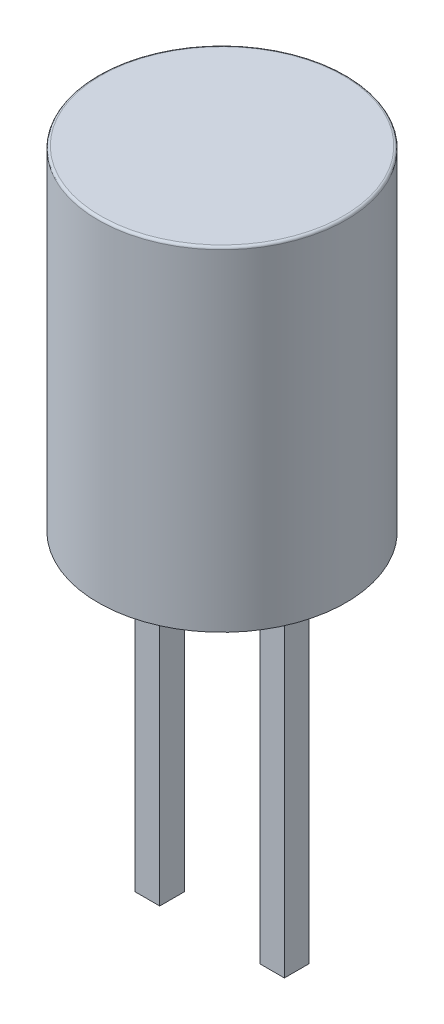
ISO-10303-21;
HEADER;
FILE_DESCRIPTION(('STEP AP214'),'2;1');
FILE_NAME('part.step','',(''),(''),'','','');
FILE_SCHEMA(('AUTOMOTIVE_DESIGN { 1 0 10303 214 1 1 1 1 }'));
ENDSEC;
DATA;
#1=APPLICATION_CONTEXT('core data for automotive mechanical design processes');
#2=APPLICATION_PROTOCOL_DEFINITION('international standard','automotive_design',2000,#1);
#3=PRODUCT_CONTEXT('',#1,'mechanical');
#4=PRODUCT('Part','Part','',(#3));
#5=PRODUCT_RELATED_PRODUCT_CATEGORY('part','',(#4));
#6=PRODUCT_DEFINITION_FORMATION('','',#4);
#7=PRODUCT_DEFINITION_CONTEXT('part definition',#1,'design');
#8=PRODUCT_DEFINITION('design','',#6,#7);
#9=PRODUCT_DEFINITION_SHAPE('','',#8);
#10=(LENGTH_UNIT() NAMED_UNIT(*) SI_UNIT(.MILLI.,.METRE.));
#11=(NAMED_UNIT(*) PLANE_ANGLE_UNIT() SI_UNIT($,.RADIAN.));
#12=(NAMED_UNIT(*) SI_UNIT($,.STERADIAN.) SOLID_ANGLE_UNIT());
#13=UNCERTAINTY_MEASURE_WITH_UNIT(LENGTH_MEASURE(1.E-05),#10,'distance_accuracy_value','');
#14=(GEOMETRIC_REPRESENTATION_CONTEXT(3) GLOBAL_UNCERTAINTY_ASSIGNED_CONTEXT((#13)) GLOBAL_UNIT_ASSIGNED_CONTEXT((#10,
#11,#12)) REPRESENTATION_CONTEXT('',''));
#15=CARTESIAN_POINT('',(0.,0.,0.));
#16=DIRECTION('',(0.,0.,1.));
#17=DIRECTION('',(1.,0.,0.));
#18=AXIS2_PLACEMENT_3D('',#15,#16,#17);
#19=CARTESIAN_POINT('',(0.,0.,0.));
#20=DIRECTION('',(0.,1.,0.));
#21=DIRECTION('',(0.,0.,-1.));
#22=AXIS2_PLACEMENT_3D('',#19,#20,#21);
#23=PLANE('',#22);
#24=DIRECTION('',(-1.,0.,0.));
#25=VECTOR('',#24,1.);
#26=CARTESIAN_POINT('',(-0.76,0.,-0.25));
#27=LINE('',#26,#25);
#28=CARTESIAN_POINT('',(-1.02,0.,-0.25));
#29=VERTEX_POINT('',#28);
#30=CARTESIAN_POINT('',(-1.52,0.,-0.25));
#31=VERTEX_POINT('',#30);
#32=EDGE_CURVE('E159',#29,#31,#27,.T.);
#33=ORIENTED_EDGE('',*,*,#32,.T.);
#34=DIRECTION('',(0.,0.,1.));
#35=VECTOR('',#34,1.);
#36=CARTESIAN_POINT('',(-1.52,0.,0.125));
#37=LINE('',#36,#35);
#38=CARTESIAN_POINT('',(-1.52,0.,0.25));
#39=VERTEX_POINT('',#38);
#40=EDGE_CURVE('E142',#31,#39,#37,.T.);
#41=ORIENTED_EDGE('',*,*,#40,.T.);
#42=DIRECTION('',(1.,0.,0.));
#43=VECTOR('',#42,1.);
#44=CARTESIAN_POINT('',(-0.51,0.,0.25));
#45=LINE('',#44,#43);
#46=CARTESIAN_POINT('',(-1.02,0.,0.25));
#47=VERTEX_POINT('',#46);
#48=EDGE_CURVE('E118',#39,#47,#45,.T.);
#49=ORIENTED_EDGE('',*,*,#48,.T.);
#50=DIRECTION('',(0.,0.,-1.));
#51=VECTOR('',#50,1.);
#52=CARTESIAN_POINT('',(-1.02,0.,-0.125));
#53=LINE('',#52,#51);
#54=EDGE_CURVE('E27',#47,#29,#53,.T.);
#55=ORIENTED_EDGE('',*,*,#54,.T.);
#56=EDGE_LOOP('',(#33,#41,#49,#55));
#57=FACE_BOUND('',#56,.T.);
#58=DIRECTION('',(-1.,0.,0.));
#59=VECTOR('',#58,1.);
#60=CARTESIAN_POINT('',(0.51,0.,-0.25));
#61=LINE('',#60,#59);
#62=CARTESIAN_POINT('',(1.52,0.,-0.25));
#63=VERTEX_POINT('',#62);
#64=CARTESIAN_POINT('',(1.02,0.,-0.25));
#65=VERTEX_POINT('',#64);
#66=EDGE_CURVE('E178',#63,#65,#61,.T.);
#67=ORIENTED_EDGE('',*,*,#66,.T.);
#68=DIRECTION('',(0.,0.,1.));
#69=VECTOR('',#68,1.);
#70=CARTESIAN_POINT('',(1.02,0.,0.125));
#71=LINE('',#70,#69);
#72=CARTESIAN_POINT('',(1.02,0.,0.25));
#73=VERTEX_POINT('',#72);
#74=EDGE_CURVE('E207',#65,#73,#71,.T.);
#75=ORIENTED_EDGE('',*,*,#74,.T.);
#76=DIRECTION('',(1.,0.,0.));
#77=VECTOR('',#76,1.);
#78=CARTESIAN_POINT('',(0.76,0.,0.25));
#79=LINE('',#78,#77);
#80=CARTESIAN_POINT('',(1.52,0.,0.25));
#81=VERTEX_POINT('',#80);
#82=EDGE_CURVE('E155',#73,#81,#79,.T.);
#83=ORIENTED_EDGE('',*,*,#82,.T.);
#84=DIRECTION('',(0.,0.,-1.));
#85=VECTOR('',#84,1.);
#86=CARTESIAN_POINT('',(1.52,0.,-0.125));
#87=LINE('',#86,#85);
#88=EDGE_CURVE('E66',#81,#63,#87,.T.);
#89=ORIENTED_EDGE('',*,*,#88,.T.);
#90=EDGE_LOOP('',(#67,#75,#83,#89));
#91=FACE_BOUND('',#90,.T.);
#92=CARTESIAN_POINT('',(0.,0.,0.));
#93=DIRECTION('',(0.,1.,0.));
#94=DIRECTION('',(1.,0.,0.));
#95=AXIS2_PLACEMENT_3D('',#92,#93,#94);
#96=CIRCLE('',#95,2.525);
#97=CARTESIAN_POINT('',(-2.525,0.,0.));
#98=VERTEX_POINT('',#97);
#99=EDGE_CURVE('E78',#98,#98,#96,.T.);
#100=ORIENTED_EDGE('',*,*,#99,.F.);
#101=EDGE_LOOP('',(#100));
#102=FACE_BOUND('',#101,.T.);
#103=ADVANCED_FACE('F16',(#57,#91,#102),#23,.F.);
#104=CARTESIAN_POINT('',(-1.27,-7.,0.));
#105=DIRECTION('',(0.,-1.,0.));
#106=DIRECTION('',(-1.,0.,0.));
#107=AXIS2_PLACEMENT_3D('',#104,#105,#106);
#108=PLANE('',#107);
#109=DIRECTION('',(0.,0.,1.));
#110=VECTOR('',#109,1.);
#111=CARTESIAN_POINT('',(-1.02,-7.,-0.25));
#112=LINE('',#111,#110);
#113=CARTESIAN_POINT('',(-1.02,-7.,-0.25));
#114=VERTEX_POINT('',#113);
#115=CARTESIAN_POINT('',(-1.02,-7.,0.25));
#116=VERTEX_POINT('',#115);
#117=EDGE_CURVE('E10',#114,#116,#112,.T.);
#118=ORIENTED_EDGE('',*,*,#117,.T.);
#119=DIRECTION('',(-1.,0.,0.));
#120=VECTOR('',#119,1.);
#121=CARTESIAN_POINT('',(-1.02,-7.,0.25));
#122=LINE('',#121,#120);
#123=CARTESIAN_POINT('',(-1.52,-7.,0.25));
#124=VERTEX_POINT('',#123);
#125=EDGE_CURVE('E123',#116,#124,#122,.T.);
#126=ORIENTED_EDGE('',*,*,#125,.T.);
#127=DIRECTION('',(0.,0.,-1.));
#128=VECTOR('',#127,1.);
#129=CARTESIAN_POINT('',(-1.52,-7.,0.25));
#130=LINE('',#129,#128);
#131=CARTESIAN_POINT('',(-1.52,-7.,-0.25));
#132=VERTEX_POINT('',#131);
#133=EDGE_CURVE('E126',#124,#132,#130,.T.);
#134=ORIENTED_EDGE('',*,*,#133,.T.);
#135=DIRECTION('',(1.,0.,0.));
#136=VECTOR('',#135,1.);
#137=CARTESIAN_POINT('',(-1.52,-7.,-0.25));
#138=LINE('',#137,#136);
#139=EDGE_CURVE('E191',#132,#114,#138,.T.);
#140=ORIENTED_EDGE('',*,*,#139,.T.);
#141=EDGE_LOOP('',(#118,#126,#134,#140));
#142=FACE_BOUND('',#141,.T.);
#143=ADVANCED_FACE('F124',(#142),#108,.T.);
#144=CARTESIAN_POINT('',(-1.02,0.,-0.25));
#145=DIRECTION('',(1.,0.,0.));
#146=DIRECTION('',(0.,1.,0.));
#147=AXIS2_PLACEMENT_3D('',#144,#145,#146);
#148=PLANE('',#147);
#149=ORIENTED_EDGE('',*,*,#54,.F.);
#150=DIRECTION('',(0.,-1.,0.));
#151=VECTOR('',#150,1.);
#152=CARTESIAN_POINT('',(-1.02,0.,0.25));
#153=LINE('',#152,#151);
#154=EDGE_CURVE('E129',#47,#116,#153,.T.);
#155=ORIENTED_EDGE('',*,*,#154,.T.);
#156=ORIENTED_EDGE('',*,*,#117,.F.);
#157=DIRECTION('',(0.,-1.,0.));
#158=VECTOR('',#157,1.);
#159=CARTESIAN_POINT('',(-1.02,0.,-0.25));
#160=LINE('',#159,#158);
#161=EDGE_CURVE('E163',#29,#114,#160,.T.);
#162=ORIENTED_EDGE('',*,*,#161,.F.);
#163=EDGE_LOOP('',(#149,#155,#156,#162));
#164=FACE_BOUND('',#163,.T.);
#165=ADVANCED_FACE('F257',(#164),#148,.T.);
#166=CARTESIAN_POINT('',(-1.02,0.,0.25));
#167=DIRECTION('',(0.,0.,1.));
#168=DIRECTION('',(0.,-1.,0.));
#169=AXIS2_PLACEMENT_3D('',#166,#167,#168);
#170=PLANE('',#169);
#171=ORIENTED_EDGE('',*,*,#48,.F.);
#172=DIRECTION('',(0.,-1.,0.));
#173=VECTOR('',#172,1.);
#174=CARTESIAN_POINT('',(-1.52,0.,0.25));
#175=LINE('',#174,#173);
#176=EDGE_CURVE('E131',#39,#124,#175,.T.);
#177=ORIENTED_EDGE('',*,*,#176,.T.);
#178=ORIENTED_EDGE('',*,*,#125,.F.);
#179=ORIENTED_EDGE('',*,*,#154,.F.);
#180=EDGE_LOOP('',(#171,#177,#178,#179));
#181=FACE_BOUND('',#180,.T.);
#182=ADVANCED_FACE('F132',(#181),#170,.T.);
#183=CARTESIAN_POINT('',(-1.52,0.,0.25));
#184=DIRECTION('',(-1.,0.,0.));
#185=DIRECTION('',(0.,0.,1.));
#186=AXIS2_PLACEMENT_3D('',#183,#184,#185);
#187=PLANE('',#186);
#188=ORIENTED_EDGE('',*,*,#40,.F.);
#189=DIRECTION('',(0.,-1.,0.));
#190=VECTOR('',#189,1.);
#191=CARTESIAN_POINT('',(-1.52,0.,-0.25));
#192=LINE('',#191,#190);
#193=EDGE_CURVE('E139',#31,#132,#192,.T.);
#194=ORIENTED_EDGE('',*,*,#193,.T.);
#195=ORIENTED_EDGE('',*,*,#133,.F.);
#196=ORIENTED_EDGE('',*,*,#176,.F.);
#197=EDGE_LOOP('',(#188,#194,#195,#196));
#198=FACE_BOUND('',#197,.T.);
#199=ADVANCED_FACE('F137',(#198),#187,.T.);
#200=CARTESIAN_POINT('',(-1.52,0.,-0.25));
#201=DIRECTION('',(0.,0.,-1.));
#202=DIRECTION('',(0.,-1.,0.));
#203=AXIS2_PLACEMENT_3D('',#200,#201,#202);
#204=PLANE('',#203);
#205=ORIENTED_EDGE('',*,*,#32,.F.);
#206=ORIENTED_EDGE('',*,*,#161,.T.);
#207=ORIENTED_EDGE('',*,*,#139,.F.);
#208=ORIENTED_EDGE('',*,*,#193,.F.);
#209=EDGE_LOOP('',(#205,#206,#207,#208));
#210=FACE_BOUND('',#209,.T.);
#211=ADVANCED_FACE('F262',(#210),#204,.T.);
#212=CARTESIAN_POINT('',(1.27,-7.,0.));
#213=DIRECTION('',(0.,-1.,0.));
#214=DIRECTION('',(-1.,0.,0.));
#215=AXIS2_PLACEMENT_3D('',#212,#213,#214);
#216=PLANE('',#215);
#217=DIRECTION('',(0.,0.,1.));
#218=VECTOR('',#217,1.);
#219=CARTESIAN_POINT('',(1.52,-7.,-0.25));
#220=LINE('',#219,#218);
#221=CARTESIAN_POINT('',(1.52,-7.,-0.25));
#222=VERTEX_POINT('',#221);
#223=CARTESIAN_POINT('',(1.52,-7.,0.25));
#224=VERTEX_POINT('',#223);
#225=EDGE_CURVE('E156',#222,#224,#220,.T.);
#226=ORIENTED_EDGE('',*,*,#225,.T.);
#227=DIRECTION('',(-1.,0.,0.));
#228=VECTOR('',#227,1.);
#229=CARTESIAN_POINT('',(1.52,-7.,0.25));
#230=LINE('',#229,#228);
#231=CARTESIAN_POINT('',(1.02,-7.,0.25));
#232=VERTEX_POINT('',#231);
#233=EDGE_CURVE('E151',#224,#232,#230,.T.);
#234=ORIENTED_EDGE('',*,*,#233,.T.);
#235=DIRECTION('',(0.,0.,-1.));
#236=VECTOR('',#235,1.);
#237=CARTESIAN_POINT('',(1.02,-7.,0.25));
#238=LINE('',#237,#236);
#239=CARTESIAN_POINT('',(1.02,-7.,-0.25));
#240=VERTEX_POINT('',#239);
#241=EDGE_CURVE('E20',#232,#240,#238,.T.);
#242=ORIENTED_EDGE('',*,*,#241,.T.);
#243=DIRECTION('',(1.,0.,0.));
#244=VECTOR('',#243,1.);
#245=CARTESIAN_POINT('',(1.02,-7.,-0.25));
#246=LINE('',#245,#244);
#247=EDGE_CURVE('E177',#240,#222,#246,.T.);
#248=ORIENTED_EDGE('',*,*,#247,.T.);
#249=EDGE_LOOP('',(#226,#234,#242,#248));
#250=FACE_BOUND('',#249,.T.);
#251=ADVANCED_FACE('F246',(#250),#216,.T.);
#252=CARTESIAN_POINT('',(1.52,0.,-0.25));
#253=DIRECTION('',(1.,0.,0.));
#254=DIRECTION('',(0.,1.,0.));
#255=AXIS2_PLACEMENT_3D('',#252,#253,#254);
#256=PLANE('',#255);
#257=ORIENTED_EDGE('',*,*,#88,.F.);
#258=DIRECTION('',(0.,-1.,0.));
#259=VECTOR('',#258,1.);
#260=CARTESIAN_POINT('',(1.52,0.,0.25));
#261=LINE('',#260,#259);
#262=EDGE_CURVE('E154',#81,#224,#261,.T.);
#263=ORIENTED_EDGE('',*,*,#262,.T.);
#264=ORIENTED_EDGE('',*,*,#225,.F.);
#265=DIRECTION('',(0.,-1.,0.));
#266=VECTOR('',#265,1.);
#267=CARTESIAN_POINT('',(1.52,0.,-0.25));
#268=LINE('',#267,#266);
#269=EDGE_CURVE('E173',#63,#222,#268,.T.);
#270=ORIENTED_EDGE('',*,*,#269,.F.);
#271=EDGE_LOOP('',(#257,#263,#264,#270));
#272=FACE_BOUND('',#271,.T.);
#273=ADVANCED_FACE('F248',(#272),#256,.T.);
#274=CARTESIAN_POINT('',(1.52,0.,0.25));
#275=DIRECTION('',(0.,0.,1.));
#276=DIRECTION('',(0.,-1.,0.));
#277=AXIS2_PLACEMENT_3D('',#274,#275,#276);
#278=PLANE('',#277);
#279=ORIENTED_EDGE('',*,*,#82,.F.);
#280=DIRECTION('',(0.,-1.,0.));
#281=VECTOR('',#280,1.);
#282=CARTESIAN_POINT('',(1.02,0.,0.25));
#283=LINE('',#282,#281);
#284=EDGE_CURVE('E185',#73,#232,#283,.T.);
#285=ORIENTED_EDGE('',*,*,#284,.T.);
#286=ORIENTED_EDGE('',*,*,#233,.F.);
#287=ORIENTED_EDGE('',*,*,#262,.F.);
#288=EDGE_LOOP('',(#279,#285,#286,#287));
#289=FACE_BOUND('',#288,.T.);
#290=ADVANCED_FACE('F238',(#289),#278,.T.);
#291=CARTESIAN_POINT('',(1.02,0.,0.25));
#292=DIRECTION('',(-1.,0.,0.));
#293=DIRECTION('',(0.,0.,1.));
#294=AXIS2_PLACEMENT_3D('',#291,#292,#293);
#295=PLANE('',#294);
#296=ORIENTED_EDGE('',*,*,#74,.F.);
#297=DIRECTION('',(0.,-1.,0.));
#298=VECTOR('',#297,1.);
#299=CARTESIAN_POINT('',(1.02,0.,-0.25));
#300=LINE('',#299,#298);
#301=EDGE_CURVE('E182',#65,#240,#300,.T.);
#302=ORIENTED_EDGE('',*,*,#301,.T.);
#303=ORIENTED_EDGE('',*,*,#241,.F.);
#304=ORIENTED_EDGE('',*,*,#284,.F.);
#305=EDGE_LOOP('',(#296,#302,#303,#304));
#306=FACE_BOUND('',#305,.T.);
#307=ADVANCED_FACE('F241',(#306),#295,.T.);
#308=CARTESIAN_POINT('',(1.02,0.,-0.25));
#309=DIRECTION('',(0.,0.,-1.));
#310=DIRECTION('',(0.,-1.,0.));
#311=AXIS2_PLACEMENT_3D('',#308,#309,#310);
#312=PLANE('',#311);
#313=ORIENTED_EDGE('',*,*,#66,.F.);
#314=ORIENTED_EDGE('',*,*,#269,.T.);
#315=ORIENTED_EDGE('',*,*,#247,.F.);
#316=ORIENTED_EDGE('',*,*,#301,.F.);
#317=EDGE_LOOP('',(#313,#314,#315,#316));
#318=FACE_BOUND('',#317,.T.);
#319=ADVANCED_FACE('F18',(#318),#312,.T.);
#320=CARTESIAN_POINT('',(0.,6.8,0.));
#321=DIRECTION('',(0.,1.,0.));
#322=DIRECTION('',(0.,0.,-1.));
#323=AXIS2_PLACEMENT_3D('',#320,#321,#322);
#324=PLANE('',#323);
#325=CARTESIAN_POINT('',(0.,6.8,0.));
#326=DIRECTION('',(0.,-1.,0.));
#327=DIRECTION('',(1.,0.,0.));
#328=AXIS2_PLACEMENT_3D('',#325,#326,#327);
#329=CIRCLE('',#328,2.475);
#330=CARTESIAN_POINT('',(-2.475,6.8,0.));
#331=VERTEX_POINT('',#330);
#332=EDGE_CURVE('E201',#331,#331,#329,.T.);
#333=ORIENTED_EDGE('',*,*,#332,.F.);
#334=EDGE_LOOP('',(#333));
#335=FACE_BOUND('',#334,.T.);
#336=ADVANCED_FACE('F269',(#335),#324,.T.);
#337=CARTESIAN_POINT('',(0.,0.,0.));
#338=DIRECTION('',(0.,1.,0.));
#339=DIRECTION('',(1.,0.,0.));
#340=AXIS2_PLACEMENT_3D('',#337,#338,#339);
#341=CYLINDRICAL_SURFACE('',#340,2.525);
#342=CARTESIAN_POINT('',(0.,6.75,0.));
#343=DIRECTION('',(0.,1.,0.));
#344=DIRECTION('',(1.,0.,0.));
#345=AXIS2_PLACEMENT_3D('',#342,#343,#344);
#346=CIRCLE('',#345,2.525);
#347=CARTESIAN_POINT('',(-2.525,6.75,0.));
#348=VERTEX_POINT('',#347);
#349=EDGE_CURVE('E164',#348,#348,#346,.T.);
#350=ORIENTED_EDGE('',*,*,#349,.F.);
#351=DIRECTION('',(0.,-1.,0.));
#352=VECTOR('',#351,1.);
#353=CARTESIAN_POINT('',(-2.525,0.,0.));
#354=LINE('',#353,#352);
#355=EDGE_CURVE('E168',#348,#98,#354,.T.);
#356=ORIENTED_EDGE('',*,*,#355,.T.);
#357=ORIENTED_EDGE('',*,*,#99,.T.);
#358=ORIENTED_EDGE('',*,*,#355,.F.);
#359=EDGE_LOOP('',(#350,#356,#357,#358));
#360=FACE_BOUND('',#359,.T.);
#361=ADVANCED_FACE('F266',(#360),#341,.T.);
#362=CARTESIAN_POINT('',(0.,6.75,0.));
#363=DIRECTION('',(0.,1.,0.));
#364=DIRECTION('',(1.,0.,0.));
#365=AXIS2_PLACEMENT_3D('',#362,#363,#364);
#366=TOROIDAL_SURFACE('',#365,2.475,0.05);
#367=ORIENTED_EDGE('',*,*,#332,.T.);
#368=CARTESIAN_POINT('',(-2.475,6.75,0.));
#369=DIRECTION('',(0.,0.,1.));
#370=DIRECTION('',(-1.,0.,0.));
#371=AXIS2_PLACEMENT_3D('',#368,#369,#370);
#372=CIRCLE('',#371,0.05);
#373=EDGE_CURVE('E169',#331,#348,#372,.T.);
#374=ORIENTED_EDGE('',*,*,#373,.T.);
#375=ORIENTED_EDGE('',*,*,#349,.T.);
#376=ORIENTED_EDGE('',*,*,#373,.F.);
#377=EDGE_LOOP('',(#367,#374,#375,#376));
#378=FACE_BOUND('',#377,.T.);
#379=ADVANCED_FACE('F268',(#378),#366,.T.);
#380=CLOSED_SHELL('',(#103,#143,#165,#182,#199,#211,#251,#273,#290,#307,#319,#336,#361,#379));
#381=MANIFOLD_SOLID_BREP('B1',#380);
#382=ADVANCED_BREP_SHAPE_REPRESENTATION('',(#18,#381),#14);
#383=SHAPE_DEFINITION_REPRESENTATION(#9,#382);
ENDSEC;
END-ISO-10303-21;
